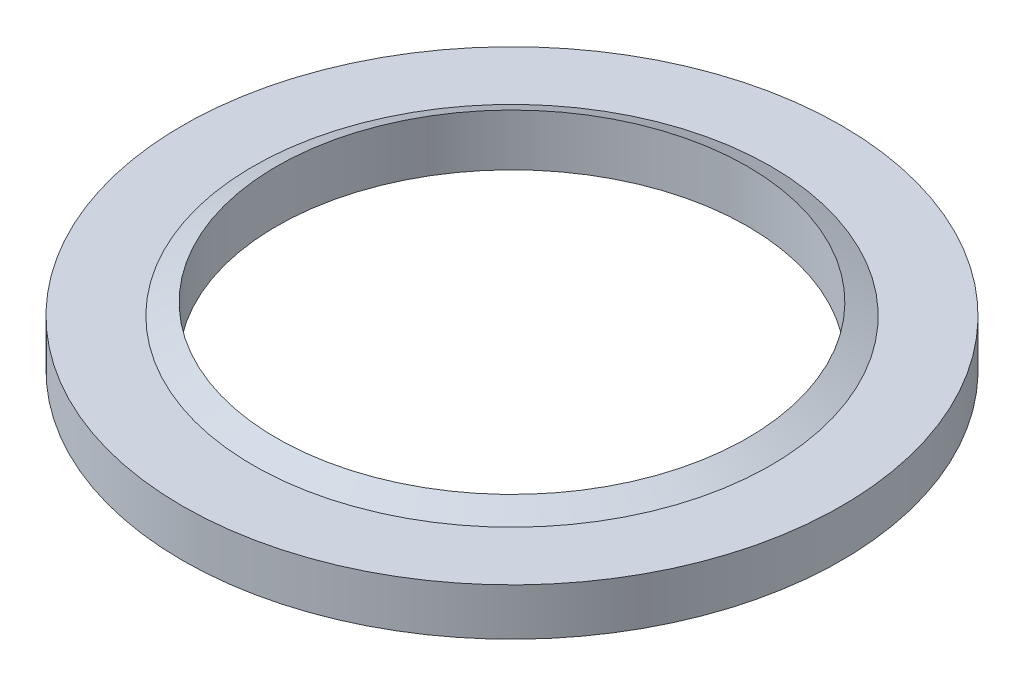
ISO-10303-21;
HEADER;
FILE_DESCRIPTION(('STEP AP214'),'2;1');
FILE_NAME('part.step','',(''),(''),'','','');
FILE_SCHEMA(('AUTOMOTIVE_DESIGN { 1 0 10303 214 1 1 1 1 }'));
ENDSEC;
DATA;
#1=APPLICATION_CONTEXT('core data for automotive mechanical design processes');
#2=APPLICATION_PROTOCOL_DEFINITION('international standard','automotive_design',2000,#1);
#3=PRODUCT_CONTEXT('',#1,'mechanical');
#4=PRODUCT('Part','Part','',(#3));
#5=PRODUCT_RELATED_PRODUCT_CATEGORY('part','',(#4));
#6=PRODUCT_DEFINITION_FORMATION('','',#4);
#7=PRODUCT_DEFINITION_CONTEXT('part definition',#1,'design');
#8=PRODUCT_DEFINITION('design','',#6,#7);
#9=PRODUCT_DEFINITION_SHAPE('','',#8);
#10=(LENGTH_UNIT() NAMED_UNIT(*) SI_UNIT(.MILLI.,.METRE.));
#11=(NAMED_UNIT(*) PLANE_ANGLE_UNIT() SI_UNIT($,.RADIAN.));
#12=(NAMED_UNIT(*) SI_UNIT($,.STERADIAN.) SOLID_ANGLE_UNIT());
#13=UNCERTAINTY_MEASURE_WITH_UNIT(LENGTH_MEASURE(1.E-05),#10,'distance_accuracy_value','');
#14=(GEOMETRIC_REPRESENTATION_CONTEXT(3) GLOBAL_UNCERTAINTY_ASSIGNED_CONTEXT((#13)) GLOBAL_UNIT_ASSIGNED_CONTEXT((#10,
#11,#12)) REPRESENTATION_CONTEXT('',''));
#15=CARTESIAN_POINT('',(0.,0.,0.));
#16=DIRECTION('',(0.,0.,1.));
#17=DIRECTION('',(1.,0.,0.));
#18=AXIS2_PLACEMENT_3D('',#15,#16,#17);
#19=CARTESIAN_POINT('',(0.,0.,0.));
#20=DIRECTION('',(0.,-1.,0.));
#21=DIRECTION('',(0.,0.,-1.));
#22=AXIS2_PLACEMENT_3D('',#19,#20,#21);
#23=CYLINDRICAL_SURFACE('',#22,10.);
#24=CARTESIAN_POINT('',(0.,2.5,0.));
#25=DIRECTION('',(0.,-1.,0.));
#26=DIRECTION('',(0.,0.,-1.));
#27=AXIS2_PLACEMENT_3D('',#24,#25,#26);
#28=CIRCLE('',#27,10.);
#29=CARTESIAN_POINT('',(0.,2.5,-10.));
#30=VERTEX_POINT('',#29);
#31=EDGE_CURVE('E39',#30,#30,#28,.T.);
#32=ORIENTED_EDGE('',*,*,#31,.F.);
#33=EDGE_LOOP('',(#32));
#34=FACE_BOUND('',#33,.T.);
#35=CARTESIAN_POINT('',(0.,0.3,0.));
#36=DIRECTION('',(0.,-1.,0.));
#37=DIRECTION('',(0.,0.,-1.));
#38=AXIS2_PLACEMENT_3D('',#35,#36,#37);
#39=CIRCLE('',#38,10.);
#40=CARTESIAN_POINT('',(0.,0.3,-10.));
#41=VERTEX_POINT('',#40);
#42=EDGE_CURVE('E56',#41,#41,#39,.T.);
#43=ORIENTED_EDGE('',*,*,#42,.T.);
#44=EDGE_LOOP('',(#43));
#45=FACE_BOUND('',#44,.T.);
#46=ADVANCED_FACE('F32',(#34,#45),#23,.F.);
#47=CARTESIAN_POINT('',(0.,2.,0.));
#48=DIRECTION('',(0.,-1.,0.));
#49=DIRECTION('',(0.,0.,-1.));
#50=AXIS2_PLACEMENT_3D('',#47,#48,#49);
#51=PLANE('',#50);
#52=CARTESIAN_POINT('',(0.,2.,0.));
#53=DIRECTION('',(0.,-1.,0.));
#54=DIRECTION('',(0.,0.,-1.));
#55=AXIS2_PLACEMENT_3D('',#52,#53,#54);
#56=CIRCLE('',#55,14.);
#57=CARTESIAN_POINT('',(0.,2.,-14.));
#58=VERTEX_POINT('',#57);
#59=EDGE_CURVE('E47',#58,#58,#56,.T.);
#60=ORIENTED_EDGE('',*,*,#59,.F.);
#61=EDGE_LOOP('',(#60));
#62=FACE_BOUND('',#61,.T.);
#63=CARTESIAN_POINT('',(0.,2.,0.));
#64=DIRECTION('',(0.,-1.,0.));
#65=DIRECTION('',(0.,0.,-1.));
#66=AXIS2_PLACEMENT_3D('',#63,#64,#65);
#67=CIRCLE('',#66,11.);
#68=CARTESIAN_POINT('',(0.,2.,-11.));
#69=VERTEX_POINT('',#68);
#70=EDGE_CURVE('E10',#69,#69,#67,.T.);
#71=ORIENTED_EDGE('',*,*,#70,.T.);
#72=EDGE_LOOP('',(#71));
#73=FACE_BOUND('',#72,.T.);
#74=ADVANCED_FACE('F34',(#62,#73),#51,.F.);
#75=CARTESIAN_POINT('',(0.,2.5,0.));
#76=DIRECTION('',(0.,-1.,0.));
#77=DIRECTION('',(0.,0.,-1.));
#78=AXIS2_PLACEMENT_3D('',#75,#76,#77);
#79=CONICAL_SURFACE('',#78,10.,1.10714871779409);
#80=ORIENTED_EDGE('',*,*,#70,.F.);
#81=EDGE_LOOP('',(#80));
#82=FACE_BOUND('',#81,.T.);
#83=ORIENTED_EDGE('',*,*,#31,.T.);
#84=EDGE_LOOP('',(#83));
#85=FACE_BOUND('',#84,.T.);
#86=ADVANCED_FACE('F79',(#82,#85),#79,.T.);
#87=CARTESIAN_POINT('',(0.,0.,0.));
#88=DIRECTION('',(0.,-1.,0.));
#89=DIRECTION('',(0.,0.,-1.));
#90=AXIS2_PLACEMENT_3D('',#87,#88,#89);
#91=PLANE('',#90);
#92=CARTESIAN_POINT('',(0.,0.,0.));
#93=DIRECTION('',(0.,-1.,0.));
#94=DIRECTION('',(0.,0.,-1.));
#95=AXIS2_PLACEMENT_3D('',#92,#93,#94);
#96=CIRCLE('',#95,10.5);
#97=CARTESIAN_POINT('',(0.,0.,-10.5));
#98=VERTEX_POINT('',#97);
#99=EDGE_CURVE('E53',#98,#98,#96,.T.);
#100=ORIENTED_EDGE('',*,*,#99,.F.);
#101=EDGE_LOOP('',(#100));
#102=FACE_BOUND('',#101,.T.);
#103=CARTESIAN_POINT('',(0.,0.,0.));
#104=DIRECTION('',(0.,-1.,0.));
#105=DIRECTION('',(0.,0.,-1.));
#106=AXIS2_PLACEMENT_3D('',#103,#104,#105);
#107=CIRCLE('',#106,14.);
#108=CARTESIAN_POINT('',(0.,0.,-14.));
#109=VERTEX_POINT('',#108);
#110=EDGE_CURVE('E43',#109,#109,#107,.T.);
#111=ORIENTED_EDGE('',*,*,#110,.T.);
#112=EDGE_LOOP('',(#111));
#113=FACE_BOUND('',#112,.T.);
#114=ADVANCED_FACE('F76',(#102,#113),#91,.T.);
#115=CARTESIAN_POINT('',(0.,0.,0.));
#116=DIRECTION('',(0.,-1.,0.));
#117=DIRECTION('',(0.,0.,-1.));
#118=AXIS2_PLACEMENT_3D('',#115,#116,#117);
#119=CYLINDRICAL_SURFACE('',#118,14.);
#120=ORIENTED_EDGE('',*,*,#59,.T.);
#121=EDGE_LOOP('',(#120));
#122=FACE_BOUND('',#121,.T.);
#123=ORIENTED_EDGE('',*,*,#110,.F.);
#124=EDGE_LOOP('',(#123));
#125=FACE_BOUND('',#124,.T.);
#126=ADVANCED_FACE('F72',(#122,#125),#119,.T.);
#127=CARTESIAN_POINT('',(0.,0.3,0.));
#128=DIRECTION('',(0.,-1.,0.));
#129=DIRECTION('',(0.,0.,-1.));
#130=AXIS2_PLACEMENT_3D('',#127,#128,#129);
#131=CYLINDRICAL_SURFACE('',#130,10.5);
#132=CARTESIAN_POINT('',(0.,0.3,0.));
#133=DIRECTION('',(0.,-1.,0.));
#134=DIRECTION('',(0.,0.,-1.));
#135=AXIS2_PLACEMENT_3D('',#132,#133,#134);
#136=CIRCLE('',#135,10.5);
#137=CARTESIAN_POINT('',(0.,0.3,-10.5));
#138=VERTEX_POINT('',#137);
#139=EDGE_CURVE('E52',#138,#138,#136,.T.);
#140=ORIENTED_EDGE('',*,*,#139,.F.);
#141=EDGE_LOOP('',(#140));
#142=FACE_BOUND('',#141,.T.);
#143=ORIENTED_EDGE('',*,*,#99,.T.);
#144=EDGE_LOOP('',(#143));
#145=FACE_BOUND('',#144,.T.);
#146=ADVANCED_FACE('F66',(#142,#145),#131,.F.);
#147=CARTESIAN_POINT('',(0.,0.3,0.));
#148=DIRECTION('',(0.,-1.,0.));
#149=DIRECTION('',(0.,0.,-1.));
#150=AXIS2_PLACEMENT_3D('',#147,#148,#149);
#151=PLANE('',#150);
#152=ORIENTED_EDGE('',*,*,#42,.F.);
#153=EDGE_LOOP('',(#152));
#154=FACE_BOUND('',#153,.T.);
#155=ORIENTED_EDGE('',*,*,#139,.T.);
#156=EDGE_LOOP('',(#155));
#157=FACE_BOUND('',#156,.T.);
#158=ADVANCED_FACE('F63',(#154,#157),#151,.T.);
#159=CLOSED_SHELL('',(#46,#74,#86,#114,#126,#146,#158));
#160=MANIFOLD_SOLID_BREP('B2',#159);
#161=ADVANCED_BREP_SHAPE_REPRESENTATION('',(#18,#160),#14);
#162=SHAPE_DEFINITION_REPRESENTATION(#9,#161);
ENDSEC;
END-ISO-10303-21;
